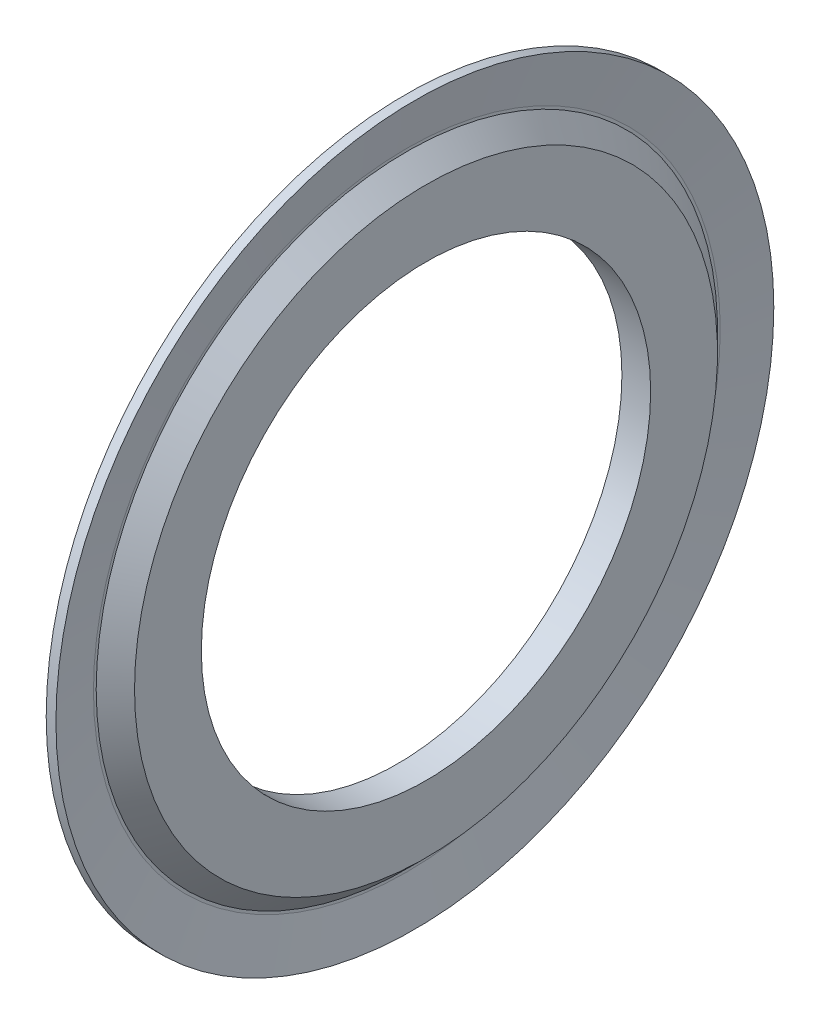
ISO-10303-21;
HEADER;
FILE_DESCRIPTION(('STEP AP214'),'2;1');
FILE_NAME('part.step','',(''),(''),'','','');
FILE_SCHEMA(('AUTOMOTIVE_DESIGN { 1 0 10303 214 1 1 1 1 }'));
ENDSEC;
DATA;
#1=APPLICATION_CONTEXT('core data for automotive mechanical design processes');
#2=APPLICATION_PROTOCOL_DEFINITION('international standard','automotive_design',2000,#1);
#3=PRODUCT_CONTEXT('',#1,'mechanical');
#4=PRODUCT('Part','Part','',(#3));
#5=PRODUCT_RELATED_PRODUCT_CATEGORY('part','',(#4));
#6=PRODUCT_DEFINITION_FORMATION('','',#4);
#7=PRODUCT_DEFINITION_CONTEXT('part definition',#1,'design');
#8=PRODUCT_DEFINITION('design','',#6,#7);
#9=PRODUCT_DEFINITION_SHAPE('','',#8);
#10=(LENGTH_UNIT() NAMED_UNIT(*) SI_UNIT(.MILLI.,.METRE.));
#11=(NAMED_UNIT(*) PLANE_ANGLE_UNIT() SI_UNIT($,.RADIAN.));
#12=(NAMED_UNIT(*) SI_UNIT($,.STERADIAN.) SOLID_ANGLE_UNIT());
#13=UNCERTAINTY_MEASURE_WITH_UNIT(LENGTH_MEASURE(1.E-05),#10,'distance_accuracy_value','');
#14=(GEOMETRIC_REPRESENTATION_CONTEXT(3) GLOBAL_UNCERTAINTY_ASSIGNED_CONTEXT((#13)) GLOBAL_UNIT_ASSIGNED_CONTEXT((#10,
#11,#12)) REPRESENTATION_CONTEXT('',''));
#15=CARTESIAN_POINT('',(0.,0.,0.));
#16=DIRECTION('',(0.,0.,1.));
#17=DIRECTION('',(1.,0.,0.));
#18=AXIS2_PLACEMENT_3D('',#15,#16,#17);
#19=CARTESIAN_POINT('',(4.28407461162317,0.,0.));
#20=DIRECTION('',(1.,0.,0.));
#21=DIRECTION('',(0.,0.,-1.));
#22=AXIS2_PLACEMENT_3D('',#19,#20,#21);
#23=CONICAL_SURFACE('',#22,6.,1.39626340159546);
#24=CARTESIAN_POINT('',(4.4346578531482,0.,0.));
#25=DIRECTION('',(-1.,0.,0.));
#26=DIRECTION('',(0.,0.,1.));
#27=AXIS2_PLACEMENT_3D('',#24,#25,#26);
#28=CIRCLE('',#27,6.854);
#29=CARTESIAN_POINT('',(4.4346578531482,0.,6.854));
#30=VERTEX_POINT('',#29);
#31=EDGE_CURVE('E71',#30,#30,#28,.T.);
#32=ORIENTED_EDGE('',*,*,#31,.T.);
#33=EDGE_LOOP('',(#32));
#34=FACE_BOUND('',#33,.T.);
#35=CARTESIAN_POINT('',(4.28407461162317,0.,0.));
#36=DIRECTION('',(-1.,0.,0.));
#37=DIRECTION('',(0.,0.,1.));
#38=AXIS2_PLACEMENT_3D('',#35,#36,#37);
#39=CIRCLE('',#38,6.);
#40=CARTESIAN_POINT('',(4.28407461162317,0.,6.));
#41=VERTEX_POINT('',#40);
#42=EDGE_CURVE('E10',#41,#41,#39,.T.);
#43=ORIENTED_EDGE('',*,*,#42,.F.);
#44=EDGE_LOOP('',(#43));
#45=FACE_BOUND('',#44,.T.);
#46=ADVANCED_FACE('F14',(#34,#45),#23,.T.);
#47=CARTESIAN_POINT('',(4.28407461162317,6.,0.));
#48=DIRECTION('',(1.,0.,0.));
#49=DIRECTION('',(0.,0.,-1.));
#50=AXIS2_PLACEMENT_3D('',#47,#48,#49);
#51=PLANE('',#50);
#52=CARTESIAN_POINT('',(4.28407461162317,0.,0.));
#53=DIRECTION('',(-1.,0.,0.));
#54=DIRECTION('',(0.,0.,1.));
#55=AXIS2_PLACEMENT_3D('',#52,#53,#54);
#56=CIRCLE('',#55,5.856);
#57=CARTESIAN_POINT('',(4.28407461162317,0.,5.856));
#58=VERTEX_POINT('',#57);
#59=EDGE_CURVE('E21',#58,#58,#56,.T.);
#60=ORIENTED_EDGE('',*,*,#59,.F.);
#61=EDGE_LOOP('',(#60));
#62=FACE_BOUND('',#61,.T.);
#63=ORIENTED_EDGE('',*,*,#42,.T.);
#64=EDGE_LOOP('',(#63));
#65=FACE_BOUND('',#64,.T.);
#66=ADVANCED_FACE('F92',(#62,#65),#51,.F.);
#67=CARTESIAN_POINT('',(4.65007461162317,0.,0.));
#68=DIRECTION('',(-1.,0.,0.));
#69=DIRECTION('',(0.,0.,1.));
#70=AXIS2_PLACEMENT_3D('',#67,#68,#69);
#71=CONICAL_SURFACE('',#70,5.49,0.785398163397448);
#72=ORIENTED_EDGE('',*,*,#59,.T.);
#73=EDGE_LOOP('',(#72));
#74=FACE_BOUND('',#73,.T.);
#75=CARTESIAN_POINT('',(4.65007461162317,0.,0.));
#76=DIRECTION('',(-1.,0.,0.));
#77=DIRECTION('',(0.,0.,1.));
#78=AXIS2_PLACEMENT_3D('',#75,#76,#77);
#79=CIRCLE('',#78,5.49);
#80=CARTESIAN_POINT('',(4.65007461162317,0.,5.49));
#81=VERTEX_POINT('',#80);
#82=EDGE_CURVE('E30',#81,#81,#79,.T.);
#83=ORIENTED_EDGE('',*,*,#82,.F.);
#84=EDGE_LOOP('',(#83));
#85=FACE_BOUND('',#84,.T.);
#86=ADVANCED_FACE('F96',(#74,#85),#71,.F.);
#87=CARTESIAN_POINT('',(4.65007461162317,4.473,0.));
#88=DIRECTION('',(-1.,0.,0.));
#89=DIRECTION('',(0.,0.,1.));
#90=AXIS2_PLACEMENT_3D('',#87,#88,#89);
#91=PLANE('',#90);
#92=ORIENTED_EDGE('',*,*,#82,.T.);
#93=EDGE_LOOP('',(#92));
#94=FACE_BOUND('',#93,.T.);
#95=CARTESIAN_POINT('',(4.65007461162317,0.,0.));
#96=DIRECTION('',(-1.,0.,0.));
#97=DIRECTION('',(0.,0.,1.));
#98=AXIS2_PLACEMENT_3D('',#95,#96,#97);
#99=CIRCLE('',#98,4.473);
#100=CARTESIAN_POINT('',(4.65007461162317,0.,4.473));
#101=VERTEX_POINT('',#100);
#102=EDGE_CURVE('E37',#101,#101,#99,.T.);
#103=ORIENTED_EDGE('',*,*,#102,.F.);
#104=EDGE_LOOP('',(#103));
#105=FACE_BOUND('',#104,.T.);
#106=ADVANCED_FACE('F101',(#94,#105),#91,.T.);
#107=CARTESIAN_POINT('',(4.28407461162317,0.,0.));
#108=DIRECTION('',(-1.,0.,0.));
#109=DIRECTION('',(0.,0.,1.));
#110=AXIS2_PLACEMENT_3D('',#107,#108,#109);
#111=CYLINDRICAL_SURFACE('',#110,4.473);
#112=ORIENTED_EDGE('',*,*,#102,.T.);
#113=EDGE_LOOP('',(#112));
#114=FACE_BOUND('',#113,.T.);
#115=CARTESIAN_POINT('',(4.28407461162317,0.,0.));
#116=DIRECTION('',(-1.,0.,0.));
#117=DIRECTION('',(0.,0.,1.));
#118=AXIS2_PLACEMENT_3D('',#115,#116,#117);
#119=CIRCLE('',#118,4.473);
#120=CARTESIAN_POINT('',(4.28407461162317,0.,4.473));
#121=VERTEX_POINT('',#120);
#122=EDGE_CURVE('E43',#121,#121,#119,.T.);
#123=ORIENTED_EDGE('',*,*,#122,.F.);
#124=EDGE_LOOP('',(#123));
#125=FACE_BOUND('',#124,.T.);
#126=ADVANCED_FACE('F106',(#114,#125),#111,.T.);
#127=CARTESIAN_POINT('',(4.28407461162317,4.29,0.));
#128=DIRECTION('',(-1.,0.,0.));
#129=DIRECTION('',(0.,0.,1.));
#130=AXIS2_PLACEMENT_3D('',#127,#128,#129);
#131=PLANE('',#130);
#132=ORIENTED_EDGE('',*,*,#122,.T.);
#133=EDGE_LOOP('',(#132));
#134=FACE_BOUND('',#133,.T.);
#135=CARTESIAN_POINT('',(4.28407461162317,0.,0.));
#136=DIRECTION('',(-1.,0.,0.));
#137=DIRECTION('',(0.,0.,1.));
#138=AXIS2_PLACEMENT_3D('',#135,#136,#137);
#139=CIRCLE('',#138,4.29);
#140=CARTESIAN_POINT('',(4.28407461162317,0.,4.29));
#141=VERTEX_POINT('',#140);
#142=EDGE_CURVE('E47',#141,#141,#139,.T.);
#143=ORIENTED_EDGE('',*,*,#142,.F.);
#144=EDGE_LOOP('',(#143));
#145=FACE_BOUND('',#144,.T.);
#146=ADVANCED_FACE('F110',(#134,#145),#131,.T.);
#147=CARTESIAN_POINT('',(4.28407461162317,0.,0.));
#148=DIRECTION('',(-1.,0.,0.));
#149=DIRECTION('',(0.,0.,1.));
#150=AXIS2_PLACEMENT_3D('',#147,#148,#149);
#151=CYLINDRICAL_SURFACE('',#150,4.29);
#152=CARTESIAN_POINT('',(4.83307461162317,0.,0.));
#153=DIRECTION('',(-1.,0.,0.));
#154=DIRECTION('',(0.,0.,1.));
#155=AXIS2_PLACEMENT_3D('',#152,#153,#154);
#156=CIRCLE('',#155,4.29);
#157=CARTESIAN_POINT('',(4.83307461162317,0.,4.29));
#158=VERTEX_POINT('',#157);
#159=EDGE_CURVE('E51',#158,#158,#156,.T.);
#160=ORIENTED_EDGE('',*,*,#159,.F.);
#161=EDGE_LOOP('',(#160));
#162=FACE_BOUND('',#161,.T.);
#163=ORIENTED_EDGE('',*,*,#142,.T.);
#164=EDGE_LOOP('',(#163));
#165=FACE_BOUND('',#164,.T.);
#166=ADVANCED_FACE('F114',(#162,#165),#151,.F.);
#167=CARTESIAN_POINT('',(4.83307461162317,4.29,0.));
#168=DIRECTION('',(-1.,0.,0.));
#169=DIRECTION('',(0.,0.,1.));
#170=AXIS2_PLACEMENT_3D('',#167,#168,#169);
#171=PLANE('',#170);
#172=CARTESIAN_POINT('',(4.83307461162317,0.,0.));
#173=DIRECTION('',(-1.,0.,0.));
#174=DIRECTION('',(0.,0.,1.));
#175=AXIS2_PLACEMENT_3D('',#172,#173,#174);
#176=CIRCLE('',#175,5.56580108191428);
#177=CARTESIAN_POINT('',(4.83307461162317,0.,5.56580108191428));
#178=VERTEX_POINT('',#177);
#179=EDGE_CURVE('E55',#178,#178,#176,.T.);
#180=ORIENTED_EDGE('',*,*,#179,.F.);
#181=EDGE_LOOP('',(#180));
#182=FACE_BOUND('',#181,.T.);
#183=ORIENTED_EDGE('',*,*,#159,.T.);
#184=EDGE_LOOP('',(#183));
#185=FACE_BOUND('',#184,.T.);
#186=ADVANCED_FACE('F118',(#182,#185),#171,.F.);
#187=CARTESIAN_POINT('',(4.83307461162317,0.,0.));
#188=DIRECTION('',(-1.,0.,0.));
#189=DIRECTION('',(0.,0.,1.));
#190=AXIS2_PLACEMENT_3D('',#187,#188,#189);
#191=CONICAL_SURFACE('',#190,5.56580108191428,0.785398163397448);
#192=CARTESIAN_POINT('',(4.46707461162317,0.,0.));
#193=DIRECTION('',(-1.,0.,0.));
#194=DIRECTION('',(0.,0.,1.));
#195=AXIS2_PLACEMENT_3D('',#192,#193,#194);
#196=CIRCLE('',#195,5.93180108191428);
#197=CARTESIAN_POINT('',(4.46707461162317,0.,5.93180108191428));
#198=VERTEX_POINT('',#197);
#199=EDGE_CURVE('E59',#198,#198,#196,.T.);
#200=ORIENTED_EDGE('',*,*,#199,.F.);
#201=EDGE_LOOP('',(#200));
#202=FACE_BOUND('',#201,.T.);
#203=ORIENTED_EDGE('',*,*,#179,.T.);
#204=EDGE_LOOP('',(#203));
#205=FACE_BOUND('',#204,.T.);
#206=ADVANCED_FACE('F122',(#202,#205),#191,.T.);
#207=CARTESIAN_POINT('',(4.46707461162317,5.93180108191428,0.));
#208=DIRECTION('',(-1.,0.,0.));
#209=DIRECTION('',(0.,0.,1.));
#210=AXIS2_PLACEMENT_3D('',#207,#208,#209);
#211=PLANE('',#210);
#212=CARTESIAN_POINT('',(4.46707461162317,0.,0.));
#213=DIRECTION('',(-1.,0.,0.));
#214=DIRECTION('',(0.,0.,1.));
#215=AXIS2_PLACEMENT_3D('',#212,#213,#214);
#216=CIRCLE('',#215,5.98398957457476);
#217=CARTESIAN_POINT('',(4.46707461162317,0.,5.98398957457476));
#218=VERTEX_POINT('',#217);
#219=EDGE_CURVE('E63',#218,#218,#216,.T.);
#220=ORIENTED_EDGE('',*,*,#219,.F.);
#221=EDGE_LOOP('',(#220));
#222=FACE_BOUND('',#221,.T.);
#223=ORIENTED_EDGE('',*,*,#199,.T.);
#224=EDGE_LOOP('',(#223));
#225=FACE_BOUND('',#224,.T.);
#226=ADVANCED_FACE('F88',(#222,#225),#211,.F.);
#227=CARTESIAN_POINT('',(4.46707461162317,0.,0.));
#228=DIRECTION('',(1.,0.,0.));
#229=DIRECTION('',(0.,0.,-1.));
#230=AXIS2_PLACEMENT_3D('',#227,#228,#229);
#231=CONICAL_SURFACE('',#230,5.98398957457476,1.39626340159546);
#232=CARTESIAN_POINT('',(4.62048092312329,0.,0.));
#233=DIRECTION('',(-1.,0.,0.));
#234=DIRECTION('',(0.,0.,1.));
#235=AXIS2_PLACEMENT_3D('',#232,#233,#234);
#236=CIRCLE('',#235,6.854);
#237=CARTESIAN_POINT('',(4.62048092312329,0.,6.854));
#238=VERTEX_POINT('',#237);
#239=EDGE_CURVE('E67',#238,#238,#236,.T.);
#240=ORIENTED_EDGE('',*,*,#239,.F.);
#241=EDGE_LOOP('',(#240));
#242=FACE_BOUND('',#241,.T.);
#243=ORIENTED_EDGE('',*,*,#219,.T.);
#244=EDGE_LOOP('',(#243));
#245=FACE_BOUND('',#244,.T.);
#246=ADVANCED_FACE('F81',(#242,#245),#231,.F.);
#247=CARTESIAN_POINT('',(4.28407461162317,0.,0.));
#248=DIRECTION('',(-1.,0.,0.));
#249=DIRECTION('',(0.,0.,1.));
#250=AXIS2_PLACEMENT_3D('',#247,#248,#249);
#251=CYLINDRICAL_SURFACE('',#250,6.854);
#252=ORIENTED_EDGE('',*,*,#239,.T.);
#253=EDGE_LOOP('',(#252));
#254=FACE_BOUND('',#253,.T.);
#255=ORIENTED_EDGE('',*,*,#31,.F.);
#256=EDGE_LOOP('',(#255));
#257=FACE_BOUND('',#256,.T.);
#258=ADVANCED_FACE('F79',(#254,#257),#251,.T.);
#259=CLOSED_SHELL('',(#46,#66,#86,#106,#126,#146,#166,#186,#206,#226,#246,#258));
#260=MANIFOLD_SOLID_BREP('B1',#259);
#261=ADVANCED_BREP_SHAPE_REPRESENTATION('',(#18,#260),#14);
#262=SHAPE_DEFINITION_REPRESENTATION(#9,#261);
ENDSEC;
END-ISO-10303-21;
